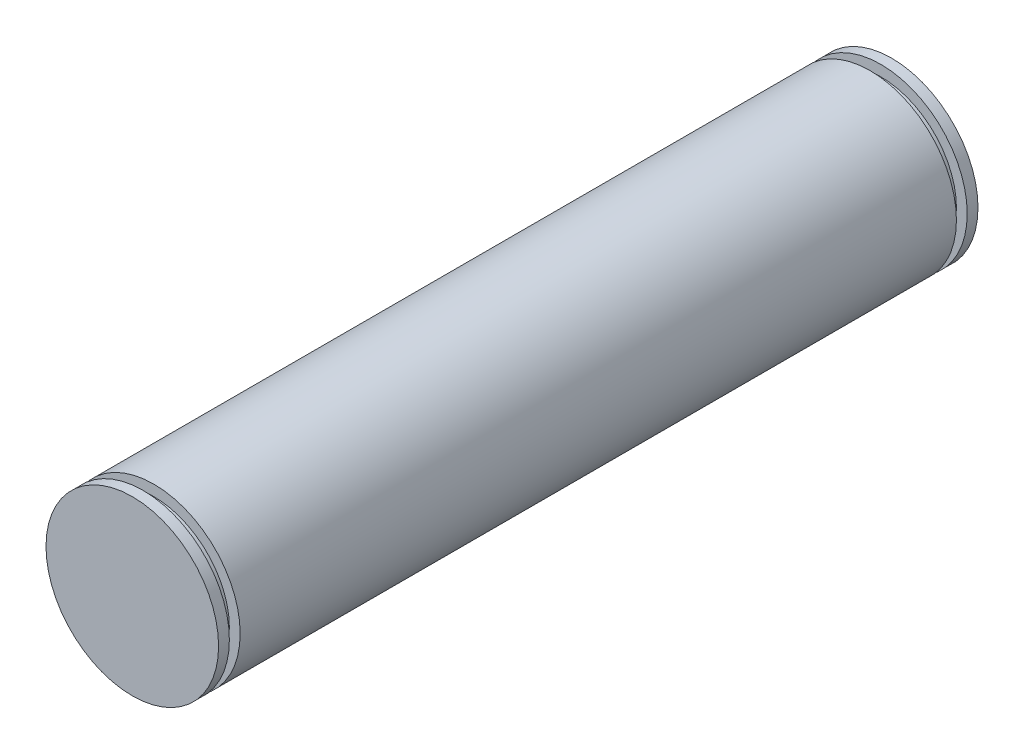
ISO-10303-21;
HEADER;
FILE_DESCRIPTION(('STEP AP214'),'2;1');
FILE_NAME('part.step','',(''),(''),'','','');
FILE_SCHEMA(('AUTOMOTIVE_DESIGN { 1 0 10303 214 1 1 1 1 }'));
ENDSEC;
DATA;
#1=APPLICATION_CONTEXT('core data for automotive mechanical design processes');
#2=APPLICATION_PROTOCOL_DEFINITION('international standard','automotive_design',2000,#1);
#3=PRODUCT_CONTEXT('',#1,'mechanical');
#4=PRODUCT('Part','Part','',(#3));
#5=PRODUCT_RELATED_PRODUCT_CATEGORY('part','',(#4));
#6=PRODUCT_DEFINITION_FORMATION('','',#4);
#7=PRODUCT_DEFINITION_CONTEXT('part definition',#1,'design');
#8=PRODUCT_DEFINITION('design','',#6,#7);
#9=PRODUCT_DEFINITION_SHAPE('','',#8);
#10=(LENGTH_UNIT() NAMED_UNIT(*) SI_UNIT(.MILLI.,.METRE.));
#11=(NAMED_UNIT(*) PLANE_ANGLE_UNIT() SI_UNIT($,.RADIAN.));
#12=(NAMED_UNIT(*) SI_UNIT($,.STERADIAN.) SOLID_ANGLE_UNIT());
#13=UNCERTAINTY_MEASURE_WITH_UNIT(LENGTH_MEASURE(1.E-05),#10,'distance_accuracy_value','');
#14=(GEOMETRIC_REPRESENTATION_CONTEXT(3) GLOBAL_UNCERTAINTY_ASSIGNED_CONTEXT((#13)) GLOBAL_UNIT_ASSIGNED_CONTEXT((#10,
#11,#12)) REPRESENTATION_CONTEXT('',''));
#15=CARTESIAN_POINT('',(0.,0.,0.));
#16=DIRECTION('',(0.,0.,1.));
#17=DIRECTION('',(1.,0.,0.));
#18=AXIS2_PLACEMENT_3D('',#15,#16,#17);
#19=CARTESIAN_POINT('',(0.,0.,-111.76));
#20=DIRECTION('',(0.,0.,-1.));
#21=DIRECTION('',(-1.,0.,0.));
#22=AXIS2_PLACEMENT_3D('',#19,#20,#21);
#23=PLANE('',#22);
#24=CARTESIAN_POINT('',(0.,0.,-111.76));
#25=DIRECTION('',(0.,0.,1.));
#26=DIRECTION('',(1.,0.,0.));
#27=AXIS2_PLACEMENT_3D('',#24,#25,#26);
#28=CIRCLE('',#27,12.7);
#29=CARTESIAN_POINT('',(12.7,0.,-111.76));
#30=VERTEX_POINT('',#29);
#31=EDGE_CURVE('E10',#30,#30,#28,.T.);
#32=ORIENTED_EDGE('',*,*,#31,.F.);
#33=EDGE_LOOP('',(#32));
#34=FACE_BOUND('',#33,.T.);
#35=ADVANCED_FACE('F15',(#34),#23,.T.);
#36=CARTESIAN_POINT('',(0.,0.,0.));
#37=DIRECTION('',(0.,0.,1.));
#38=DIRECTION('',(1.,0.,0.));
#39=AXIS2_PLACEMENT_3D('',#36,#37,#38);
#40=CYLINDRICAL_SURFACE('',#39,12.7);
#41=ORIENTED_EDGE('',*,*,#31,.T.);
#42=EDGE_LOOP('',(#41));
#43=FACE_BOUND('',#42,.T.);
#44=CARTESIAN_POINT('',(0.,0.,-110.1725));
#45=DIRECTION('',(0.,0.,1.));
#46=DIRECTION('',(1.,0.,0.));
#47=AXIS2_PLACEMENT_3D('',#44,#45,#46);
#48=CIRCLE('',#47,12.7);
#49=CARTESIAN_POINT('',(12.7,0.,-110.1725));
#50=VERTEX_POINT('',#49);
#51=EDGE_CURVE('E21',#50,#50,#48,.T.);
#52=ORIENTED_EDGE('',*,*,#51,.F.);
#53=EDGE_LOOP('',(#52));
#54=FACE_BOUND('',#53,.T.);
#55=ADVANCED_FACE('F71',(#43,#54),#40,.T.);
#56=CARTESIAN_POINT('',(12.7,0.,-110.1725));
#57=DIRECTION('',(0.,0.,1.));
#58=DIRECTION('',(1.,0.,0.));
#59=AXIS2_PLACEMENT_3D('',#56,#57,#58);
#60=PLANE('',#59);
#61=ORIENTED_EDGE('',*,*,#51,.T.);
#62=EDGE_LOOP('',(#61));
#63=FACE_BOUND('',#62,.T.);
#64=CARTESIAN_POINT('',(0.,0.,-110.1725));
#65=DIRECTION('',(0.,0.,1.));
#66=DIRECTION('',(1.,0.,0.));
#67=AXIS2_PLACEMENT_3D('',#64,#65,#66);
#68=CIRCLE('',#67,11.1125);
#69=CARTESIAN_POINT('',(11.1125,0.,-110.1725));
#70=VERTEX_POINT('',#69);
#71=EDGE_CURVE('E25',#70,#70,#68,.T.);
#72=ORIENTED_EDGE('',*,*,#71,.F.);
#73=EDGE_LOOP('',(#72));
#74=FACE_BOUND('',#73,.T.);
#75=ADVANCED_FACE('F77',(#63,#74),#60,.T.);
#76=CARTESIAN_POINT('',(0.,0.,0.));
#77=DIRECTION('',(0.,0.,1.));
#78=DIRECTION('',(1.,0.,0.));
#79=AXIS2_PLACEMENT_3D('',#76,#77,#78);
#80=CYLINDRICAL_SURFACE('',#79,11.1125);
#81=ORIENTED_EDGE('',*,*,#71,.T.);
#82=EDGE_LOOP('',(#81));
#83=FACE_BOUND('',#82,.T.);
#84=CARTESIAN_POINT('',(0.,0.,-108.585));
#85=DIRECTION('',(0.,0.,1.));
#86=DIRECTION('',(1.,0.,0.));
#87=AXIS2_PLACEMENT_3D('',#84,#85,#86);
#88=CIRCLE('',#87,11.1125);
#89=CARTESIAN_POINT('',(11.1125,0.,-108.585));
#90=VERTEX_POINT('',#89);
#91=EDGE_CURVE('E29',#90,#90,#88,.T.);
#92=ORIENTED_EDGE('',*,*,#91,.F.);
#93=EDGE_LOOP('',(#92));
#94=FACE_BOUND('',#93,.T.);
#95=ADVANCED_FACE('F82',(#83,#94),#80,.T.);
#96=CARTESIAN_POINT('',(11.1125,0.,-108.585));
#97=DIRECTION('',(0.,0.,-1.));
#98=DIRECTION('',(-1.,0.,0.));
#99=AXIS2_PLACEMENT_3D('',#96,#97,#98);
#100=PLANE('',#99);
#101=ORIENTED_EDGE('',*,*,#91,.T.);
#102=EDGE_LOOP('',(#101));
#103=FACE_BOUND('',#102,.T.);
#104=CARTESIAN_POINT('',(0.,0.,-108.585));
#105=DIRECTION('',(0.,0.,1.));
#106=DIRECTION('',(1.,0.,0.));
#107=AXIS2_PLACEMENT_3D('',#104,#105,#106);
#108=CIRCLE('',#107,12.7);
#109=CARTESIAN_POINT('',(12.7,0.,-108.585));
#110=VERTEX_POINT('',#109);
#111=EDGE_CURVE('E34',#110,#110,#108,.T.);
#112=ORIENTED_EDGE('',*,*,#111,.F.);
#113=EDGE_LOOP('',(#112));
#114=FACE_BOUND('',#113,.T.);
#115=ADVANCED_FACE('F88',(#103,#114),#100,.T.);
#116=CARTESIAN_POINT('',(0.,0.,0.));
#117=DIRECTION('',(0.,0.,1.));
#118=DIRECTION('',(1.,0.,0.));
#119=AXIS2_PLACEMENT_3D('',#116,#117,#118);
#120=CYLINDRICAL_SURFACE('',#119,12.7);
#121=ORIENTED_EDGE('',*,*,#111,.T.);
#122=EDGE_LOOP('',(#121));
#123=FACE_BOUND('',#122,.T.);
#124=CARTESIAN_POINT('',(0.,0.,-3.175));
#125=DIRECTION('',(0.,0.,1.));
#126=DIRECTION('',(1.,0.,0.));
#127=AXIS2_PLACEMENT_3D('',#124,#125,#126);
#128=CIRCLE('',#127,12.7);
#129=CARTESIAN_POINT('',(12.7,0.,-3.175));
#130=VERTEX_POINT('',#129);
#131=EDGE_CURVE('E37',#130,#130,#128,.T.);
#132=ORIENTED_EDGE('',*,*,#131,.F.);
#133=EDGE_LOOP('',(#132));
#134=FACE_BOUND('',#133,.T.);
#135=ADVANCED_FACE('F92',(#123,#134),#120,.T.);
#136=CARTESIAN_POINT('',(11.1125,0.,-3.175));
#137=DIRECTION('',(0.,0.,1.));
#138=DIRECTION('',(1.,0.,0.));
#139=AXIS2_PLACEMENT_3D('',#136,#137,#138);
#140=PLANE('',#139);
#141=ORIENTED_EDGE('',*,*,#131,.T.);
#142=EDGE_LOOP('',(#141));
#143=FACE_BOUND('',#142,.T.);
#144=CARTESIAN_POINT('',(0.,0.,-3.175));
#145=DIRECTION('',(0.,0.,1.));
#146=DIRECTION('',(1.,0.,0.));
#147=AXIS2_PLACEMENT_3D('',#144,#145,#146);
#148=CIRCLE('',#147,11.1125);
#149=CARTESIAN_POINT('',(11.1125,0.,-3.175));
#150=VERTEX_POINT('',#149);
#151=EDGE_CURVE('E40',#150,#150,#148,.T.);
#152=ORIENTED_EDGE('',*,*,#151,.F.);
#153=EDGE_LOOP('',(#152));
#154=FACE_BOUND('',#153,.T.);
#155=ADVANCED_FACE('F96',(#143,#154),#140,.T.);
#156=CARTESIAN_POINT('',(0.,0.,0.));
#157=DIRECTION('',(0.,0.,1.));
#158=DIRECTION('',(1.,0.,0.));
#159=AXIS2_PLACEMENT_3D('',#156,#157,#158);
#160=CYLINDRICAL_SURFACE('',#159,11.1125);
#161=ORIENTED_EDGE('',*,*,#151,.T.);
#162=EDGE_LOOP('',(#161));
#163=FACE_BOUND('',#162,.T.);
#164=CARTESIAN_POINT('',(0.,0.,-1.5875));
#165=DIRECTION('',(0.,0.,1.));
#166=DIRECTION('',(1.,0.,0.));
#167=AXIS2_PLACEMENT_3D('',#164,#165,#166);
#168=CIRCLE('',#167,11.1125);
#169=CARTESIAN_POINT('',(11.1125,0.,-1.5875));
#170=VERTEX_POINT('',#169);
#171=EDGE_CURVE('E43',#170,#170,#168,.T.);
#172=ORIENTED_EDGE('',*,*,#171,.F.);
#173=EDGE_LOOP('',(#172));
#174=FACE_BOUND('',#173,.T.);
#175=ADVANCED_FACE('F67',(#163,#174),#160,.T.);
#176=CARTESIAN_POINT('',(12.7,0.,-1.5875));
#177=DIRECTION('',(0.,0.,-1.));
#178=DIRECTION('',(-1.,0.,0.));
#179=AXIS2_PLACEMENT_3D('',#176,#177,#178);
#180=PLANE('',#179);
#181=ORIENTED_EDGE('',*,*,#171,.T.);
#182=EDGE_LOOP('',(#181));
#183=FACE_BOUND('',#182,.T.);
#184=CARTESIAN_POINT('',(0.,0.,-1.5875));
#185=DIRECTION('',(0.,0.,1.));
#186=DIRECTION('',(1.,0.,0.));
#187=AXIS2_PLACEMENT_3D('',#184,#185,#186);
#188=CIRCLE('',#187,12.7);
#189=CARTESIAN_POINT('',(12.7,0.,-1.5875));
#190=VERTEX_POINT('',#189);
#191=EDGE_CURVE('E46',#190,#190,#188,.T.);
#192=ORIENTED_EDGE('',*,*,#191,.F.);
#193=EDGE_LOOP('',(#192));
#194=FACE_BOUND('',#193,.T.);
#195=ADVANCED_FACE('F57',(#183,#194),#180,.T.);
#196=CARTESIAN_POINT('',(0.,0.,0.));
#197=DIRECTION('',(0.,0.,1.));
#198=DIRECTION('',(1.,0.,0.));
#199=AXIS2_PLACEMENT_3D('',#196,#197,#198);
#200=CYLINDRICAL_SURFACE('',#199,12.7);
#201=ORIENTED_EDGE('',*,*,#191,.T.);
#202=EDGE_LOOP('',(#201));
#203=FACE_BOUND('',#202,.T.);
#204=CARTESIAN_POINT('',(0.,0.,0.));
#205=DIRECTION('',(0.,0.,1.));
#206=DIRECTION('',(1.,0.,0.));
#207=AXIS2_PLACEMENT_3D('',#204,#205,#206);
#208=CIRCLE('',#207,12.7);
#209=CARTESIAN_POINT('',(12.7,0.,0.));
#210=VERTEX_POINT('',#209);
#211=EDGE_CURVE('E49',#210,#210,#208,.T.);
#212=ORIENTED_EDGE('',*,*,#211,.F.);
#213=EDGE_LOOP('',(#212));
#214=FACE_BOUND('',#213,.T.);
#215=ADVANCED_FACE('F55',(#203,#214),#200,.T.);
#216=CARTESIAN_POINT('',(0.,0.,0.));
#217=DIRECTION('',(0.,0.,1.));
#218=DIRECTION('',(1.,0.,0.));
#219=AXIS2_PLACEMENT_3D('',#216,#217,#218);
#220=PLANE('',#219);
#221=ORIENTED_EDGE('',*,*,#211,.T.);
#222=EDGE_LOOP('',(#221));
#223=FACE_BOUND('',#222,.T.);
#224=ADVANCED_FACE('F53',(#223),#220,.T.);
#225=CLOSED_SHELL('',(#35,#55,#75,#95,#115,#135,#155,#175,#195,#215,#224));
#226=MANIFOLD_SOLID_BREP('B1',#225);
#227=ADVANCED_BREP_SHAPE_REPRESENTATION('',(#18,#226),#14);
#228=SHAPE_DEFINITION_REPRESENTATION(#9,#227);
ENDSEC;
END-ISO-10303-21;
